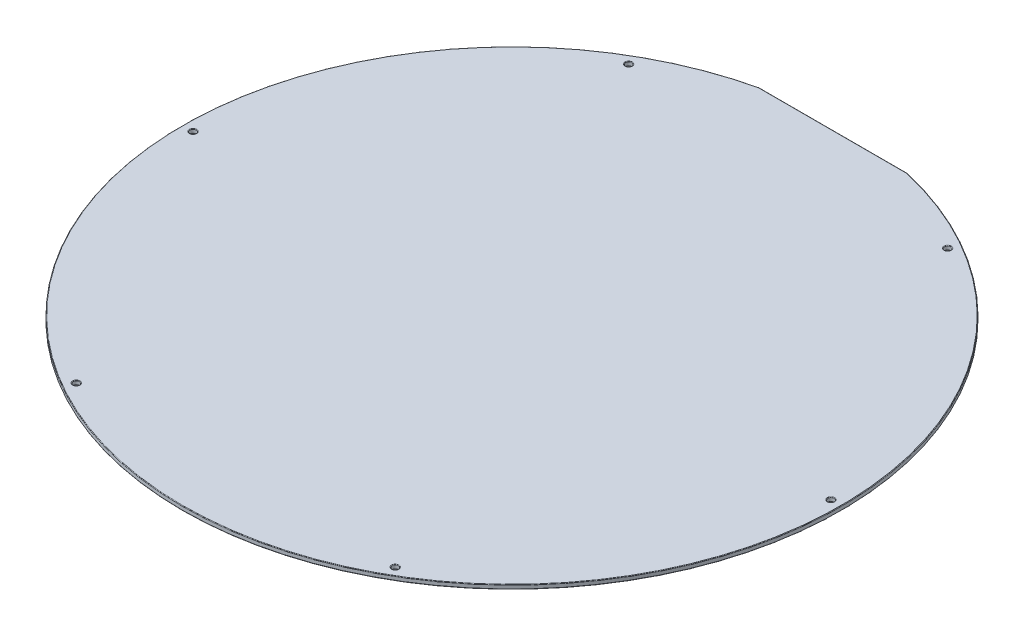
ISO-10303-21;
HEADER;
FILE_DESCRIPTION(('STEP AP214'),'2;1');
FILE_NAME('part.step','',(''),(''),'','','');
FILE_SCHEMA(('AUTOMOTIVE_DESIGN { 1 0 10303 214 1 1 1 1 }'));
ENDSEC;
DATA;
#1=APPLICATION_CONTEXT('core data for automotive mechanical design processes');
#2=APPLICATION_PROTOCOL_DEFINITION('international standard','automotive_design',2000,#1);
#3=PRODUCT_CONTEXT('',#1,'mechanical');
#4=PRODUCT('Part','Part','',(#3));
#5=PRODUCT_RELATED_PRODUCT_CATEGORY('part','',(#4));
#6=PRODUCT_DEFINITION_FORMATION('','',#4);
#7=PRODUCT_DEFINITION_CONTEXT('part definition',#1,'design');
#8=PRODUCT_DEFINITION('design','',#6,#7);
#9=PRODUCT_DEFINITION_SHAPE('','',#8);
#10=(LENGTH_UNIT() NAMED_UNIT(*) SI_UNIT(.MILLI.,.METRE.));
#11=(NAMED_UNIT(*) PLANE_ANGLE_UNIT() SI_UNIT($,.RADIAN.));
#12=(NAMED_UNIT(*) SI_UNIT($,.STERADIAN.) SOLID_ANGLE_UNIT());
#13=UNCERTAINTY_MEASURE_WITH_UNIT(LENGTH_MEASURE(1.E-05),#10,'distance_accuracy_value','');
#14=(GEOMETRIC_REPRESENTATION_CONTEXT(3) GLOBAL_UNCERTAINTY_ASSIGNED_CONTEXT((#13)) GLOBAL_UNIT_ASSIGNED_CONTEXT((#10,
#11,#12)) REPRESENTATION_CONTEXT('',''));
#15=CARTESIAN_POINT('',(0.,0.,0.));
#16=DIRECTION('',(0.,0.,1.));
#17=DIRECTION('',(1.,0.,0.));
#18=AXIS2_PLACEMENT_3D('',#15,#16,#17);
#19=CARTESIAN_POINT('',(0.,2.,0.));
#20=DIRECTION('',(0.,1.,0.));
#21=DIRECTION('',(0.,0.,1.));
#22=AXIS2_PLACEMENT_3D('',#19,#20,#21);
#23=PLANE('',#22);
#24=CARTESIAN_POINT('',(-75.,2.,-129.903810567666));
#25=DIRECTION('',(0.,1.,0.));
#26=DIRECTION('',(0.,0.,1.));
#27=AXIS2_PLACEMENT_3D('',#24,#25,#26);
#28=CIRCLE('',#27,1.75);
#29=CARTESIAN_POINT('',(-75.,2.,-128.153810567666));
#30=VERTEX_POINT('',#29);
#31=EDGE_CURVE('E11',#30,#30,#28,.F.);
#32=ORIENTED_EDGE('',*,*,#31,.T.);
#33=EDGE_LOOP('',(#32));
#34=FACE_BOUND('',#33,.T.);
#35=CARTESIAN_POINT('',(-75.,2.,129.903810567666));
#36=DIRECTION('',(0.,1.,0.));
#37=DIRECTION('',(0.,0.,1.));
#38=AXIS2_PLACEMENT_3D('',#35,#36,#37);
#39=CIRCLE('',#38,1.75);
#40=CARTESIAN_POINT('',(-75.,2.,131.653810567666));
#41=VERTEX_POINT('',#40);
#42=EDGE_CURVE('E47',#41,#41,#39,.F.);
#43=ORIENTED_EDGE('',*,*,#42,.T.);
#44=EDGE_LOOP('',(#43));
#45=FACE_BOUND('',#44,.T.);
#46=CARTESIAN_POINT('',(150.,2.,0.));
#47=DIRECTION('',(0.,1.,0.));
#48=DIRECTION('',(0.,0.,1.));
#49=AXIS2_PLACEMENT_3D('',#46,#47,#48);
#50=CIRCLE('',#49,1.75);
#51=CARTESIAN_POINT('',(150.,2.,1.75));
#52=VERTEX_POINT('',#51);
#53=EDGE_CURVE('E172',#52,#52,#50,.F.);
#54=ORIENTED_EDGE('',*,*,#53,.T.);
#55=EDGE_LOOP('',(#54));
#56=FACE_BOUND('',#55,.T.);
#57=CARTESIAN_POINT('',(0.,2.,0.));
#58=DIRECTION('',(0.,1.,0.));
#59=DIRECTION('',(0.,0.,1.));
#60=AXIS2_PLACEMENT_3D('',#57,#58,#59);
#61=CIRCLE('',#60,154.75);
#62=CARTESIAN_POINT('',(-34.9713932286477,2.,-150.746688705415));
#63=VERTEX_POINT('',#62);
#64=CARTESIAN_POINT('',(34.9713932286477,2.,-150.746688705415));
#65=VERTEX_POINT('',#64);
#66=EDGE_CURVE('E54',#63,#65,#61,.T.);
#67=ORIENTED_EDGE('',*,*,#66,.T.);
#68=DIRECTION('',(-1.,0.,0.));
#69=VECTOR('',#68,1.);
#70=CARTESIAN_POINT('',(-35.,2.,-150.746688705415));
#71=LINE('',#70,#69);
#72=EDGE_CURVE('E170',#65,#63,#71,.T.);
#73=ORIENTED_EDGE('',*,*,#72,.T.);
#74=EDGE_LOOP('',(#67,#73));
#75=FACE_BOUND('',#74,.T.);
#76=CARTESIAN_POINT('',(75.,2.,-129.903810567666));
#77=DIRECTION('',(0.,1.,0.));
#78=DIRECTION('',(0.,0.,1.));
#79=AXIS2_PLACEMENT_3D('',#76,#77,#78);
#80=CIRCLE('',#79,1.75);
#81=CARTESIAN_POINT('',(75.,2.,-128.153810567666));
#82=VERTEX_POINT('',#81);
#83=EDGE_CURVE('E166',#82,#82,#80,.F.);
#84=ORIENTED_EDGE('',*,*,#83,.T.);
#85=EDGE_LOOP('',(#84));
#86=FACE_BOUND('',#85,.T.);
#87=CARTESIAN_POINT('',(75.,2.,129.903810567666));
#88=DIRECTION('',(0.,1.,0.));
#89=DIRECTION('',(0.,0.,1.));
#90=AXIS2_PLACEMENT_3D('',#87,#88,#89);
#91=CIRCLE('',#90,1.75);
#92=CARTESIAN_POINT('',(75.,2.,131.653810567666));
#93=VERTEX_POINT('',#92);
#94=EDGE_CURVE('E163',#93,#93,#91,.F.);
#95=ORIENTED_EDGE('',*,*,#94,.T.);
#96=EDGE_LOOP('',(#95));
#97=FACE_BOUND('',#96,.T.);
#98=CARTESIAN_POINT('',(-150.,2.,0.));
#99=DIRECTION('',(0.,1.,0.));
#100=DIRECTION('',(0.,0.,1.));
#101=AXIS2_PLACEMENT_3D('',#98,#99,#100);
#102=CIRCLE('',#101,1.75);
#103=CARTESIAN_POINT('',(-150.,2.,1.75));
#104=VERTEX_POINT('',#103);
#105=EDGE_CURVE('E160',#104,#104,#102,.F.);
#106=ORIENTED_EDGE('',*,*,#105,.T.);
#107=EDGE_LOOP('',(#106));
#108=FACE_BOUND('',#107,.T.);
#109=ADVANCED_FACE('F33',(#34,#45,#56,#75,#86,#97,#108),#23,.T.);
#110=CARTESIAN_POINT('',(0.,0.,0.));
#111=DIRECTION('',(0.,1.,0.));
#112=DIRECTION('',(0.,0.,1.));
#113=AXIS2_PLACEMENT_3D('',#110,#111,#112);
#114=PLANE('',#113);
#115=CARTESIAN_POINT('',(-75.,0.,-129.903810567666));
#116=DIRECTION('',(0.,1.,0.));
#117=DIRECTION('',(0.,0.,1.));
#118=AXIS2_PLACEMENT_3D('',#115,#116,#117);
#119=CIRCLE('',#118,1.75);
#120=CARTESIAN_POINT('',(-75.,0.,-128.153810567666));
#121=VERTEX_POINT('',#120);
#122=EDGE_CURVE('E113',#121,#121,#119,.T.);
#123=ORIENTED_EDGE('',*,*,#122,.T.);
#124=EDGE_LOOP('',(#123));
#125=FACE_BOUND('',#124,.T.);
#126=CARTESIAN_POINT('',(-75.,0.,129.903810567666));
#127=DIRECTION('',(0.,1.,0.));
#128=DIRECTION('',(0.,0.,1.));
#129=AXIS2_PLACEMENT_3D('',#126,#127,#128);
#130=CIRCLE('',#129,1.75);
#131=CARTESIAN_POINT('',(-75.,0.,131.653810567666));
#132=VERTEX_POINT('',#131);
#133=EDGE_CURVE('E107',#132,#132,#130,.T.);
#134=ORIENTED_EDGE('',*,*,#133,.T.);
#135=EDGE_LOOP('',(#134));
#136=FACE_BOUND('',#135,.T.);
#137=CARTESIAN_POINT('',(150.,0.,0.));
#138=DIRECTION('',(0.,1.,0.));
#139=DIRECTION('',(0.,0.,1.));
#140=AXIS2_PLACEMENT_3D('',#137,#138,#139);
#141=CIRCLE('',#140,1.75);
#142=CARTESIAN_POINT('',(150.,0.,1.75));
#143=VERTEX_POINT('',#142);
#144=EDGE_CURVE('E104',#143,#143,#141,.T.);
#145=ORIENTED_EDGE('',*,*,#144,.T.);
#146=EDGE_LOOP('',(#145));
#147=FACE_BOUND('',#146,.T.);
#148=CARTESIAN_POINT('',(0.,0.,0.));
#149=DIRECTION('',(0.,1.,0.));
#150=DIRECTION('',(0.,0.,1.));
#151=AXIS2_PLACEMENT_3D('',#148,#149,#150);
#152=CIRCLE('',#151,154.75);
#153=CARTESIAN_POINT('',(34.9713932286477,0.,-150.746688705415));
#154=VERTEX_POINT('',#153);
#155=CARTESIAN_POINT('',(-34.9713932286477,0.,-150.746688705415));
#156=VERTEX_POINT('',#155);
#157=EDGE_CURVE('E97',#154,#156,#152,.F.);
#158=ORIENTED_EDGE('',*,*,#157,.T.);
#159=DIRECTION('',(-1.,0.,0.));
#160=VECTOR('',#159,1.);
#161=CARTESIAN_POINT('',(0.,0.,-150.746688705415));
#162=LINE('',#161,#160);
#163=EDGE_CURVE('E88',#156,#154,#162,.F.);
#164=ORIENTED_EDGE('',*,*,#163,.T.);
#165=EDGE_LOOP('',(#158,#164));
#166=FACE_BOUND('',#165,.T.);
#167=CARTESIAN_POINT('',(75.,0.,-129.903810567666));
#168=DIRECTION('',(0.,1.,0.));
#169=DIRECTION('',(0.,0.,1.));
#170=AXIS2_PLACEMENT_3D('',#167,#168,#169);
#171=CIRCLE('',#170,1.75);
#172=CARTESIAN_POINT('',(75.,0.,-128.153810567666));
#173=VERTEX_POINT('',#172);
#174=EDGE_CURVE('E100',#173,#173,#171,.T.);
#175=ORIENTED_EDGE('',*,*,#174,.T.);
#176=EDGE_LOOP('',(#175));
#177=FACE_BOUND('',#176,.T.);
#178=CARTESIAN_POINT('',(75.,0.,129.903810567666));
#179=DIRECTION('',(0.,1.,0.));
#180=DIRECTION('',(0.,0.,1.));
#181=AXIS2_PLACEMENT_3D('',#178,#179,#180);
#182=CIRCLE('',#181,1.75);
#183=CARTESIAN_POINT('',(75.,0.,131.653810567666));
#184=VERTEX_POINT('',#183);
#185=EDGE_CURVE('E239',#184,#184,#182,.T.);
#186=ORIENTED_EDGE('',*,*,#185,.T.);
#187=EDGE_LOOP('',(#186));
#188=FACE_BOUND('',#187,.T.);
#189=CARTESIAN_POINT('',(-150.,0.,0.));
#190=DIRECTION('',(0.,1.,0.));
#191=DIRECTION('',(0.,0.,1.));
#192=AXIS2_PLACEMENT_3D('',#189,#190,#191);
#193=CIRCLE('',#192,1.75);
#194=CARTESIAN_POINT('',(-150.,0.,1.75));
#195=VERTEX_POINT('',#194);
#196=EDGE_CURVE('E236',#195,#195,#193,.T.);
#197=ORIENTED_EDGE('',*,*,#196,.T.);
#198=EDGE_LOOP('',(#197));
#199=FACE_BOUND('',#198,.T.);
#200=ADVANCED_FACE('F102',(#125,#136,#147,#166,#177,#188,#199),#114,.F.);
#201=CARTESIAN_POINT('',(0.,2.,0.));
#202=DIRECTION('',(0.,-1.,0.));
#203=DIRECTION('',(0.,0.,-1.));
#204=AXIS2_PLACEMENT_3D('',#201,#202,#203);
#205=CYLINDRICAL_SURFACE('',#204,155.);
#206=DIRECTION('',(0.,-1.,0.));
#207=VECTOR('',#206,1.);
#208=CARTESIAN_POINT('',(-35.,2.,-150.996688705415));
#209=LINE('',#208,#207);
#210=CARTESIAN_POINT('',(-35.,1.75,-150.996688705415));
#211=VERTEX_POINT('',#210);
#212=CARTESIAN_POINT('',(-35.,0.25,-150.996688705415));
#213=VERTEX_POINT('',#212);
#214=EDGE_CURVE('E94',#211,#213,#209,.T.);
#215=ORIENTED_EDGE('',*,*,#214,.T.);
#216=CARTESIAN_POINT('',(0.,0.25,0.));
#217=DIRECTION('',(0.,1.,0.));
#218=DIRECTION('',(0.,0.,1.));
#219=AXIS2_PLACEMENT_3D('',#216,#217,#218);
#220=CIRCLE('',#219,155.);
#221=CARTESIAN_POINT('',(35.,0.25,-150.996688705415));
#222=VERTEX_POINT('',#221);
#223=EDGE_CURVE('E140',#213,#222,#220,.T.);
#224=ORIENTED_EDGE('',*,*,#223,.T.);
#225=DIRECTION('',(0.,-1.,0.));
#226=VECTOR('',#225,1.);
#227=CARTESIAN_POINT('',(35.,2.,-150.996688705415));
#228=LINE('',#227,#226);
#229=CARTESIAN_POINT('',(35.,1.75,-150.996688705415));
#230=VERTEX_POINT('',#229);
#231=EDGE_CURVE('E234',#230,#222,#228,.T.);
#232=ORIENTED_EDGE('',*,*,#231,.F.);
#233=CARTESIAN_POINT('',(0.,1.75,0.));
#234=DIRECTION('',(0.,1.,0.));
#235=DIRECTION('',(0.,0.,1.));
#236=AXIS2_PLACEMENT_3D('',#233,#234,#235);
#237=CIRCLE('',#236,155.);
#238=EDGE_CURVE('E138',#230,#211,#237,.F.);
#239=ORIENTED_EDGE('',*,*,#238,.T.);
#240=EDGE_LOOP('',(#215,#224,#232,#239));
#241=FACE_BOUND('',#240,.T.);
#242=ADVANCED_FACE('F235',(#241),#205,.T.);
#243=CARTESIAN_POINT('',(-35.,2.,-150.996688705415));
#244=DIRECTION('',(0.,0.,1.));
#245=DIRECTION('',(1.,0.,0.));
#246=AXIS2_PLACEMENT_3D('',#243,#244,#245);
#247=PLANE('',#246);
#248=ORIENTED_EDGE('',*,*,#231,.T.);
#249=DIRECTION('',(-1.,0.,0.));
#250=VECTOR('',#249,1.);
#251=CARTESIAN_POINT('',(-35.,0.25,-150.996688705415));
#252=LINE('',#251,#250);
#253=EDGE_CURVE('E91',#222,#213,#252,.T.);
#254=ORIENTED_EDGE('',*,*,#253,.T.);
#255=ORIENTED_EDGE('',*,*,#214,.F.);
#256=DIRECTION('',(-1.,0.,0.));
#257=VECTOR('',#256,1.);
#258=CARTESIAN_POINT('',(35.,1.75,-150.996688705415));
#259=LINE('',#258,#257);
#260=EDGE_CURVE('E134',#211,#230,#259,.F.);
#261=ORIENTED_EDGE('',*,*,#260,.T.);
#262=EDGE_LOOP('',(#248,#254,#255,#261));
#263=FACE_BOUND('',#262,.T.);
#264=ADVANCED_FACE('F233',(#263),#247,.F.);
#265=CARTESIAN_POINT('',(75.,2.,-129.903810567666));
#266=DIRECTION('',(0.,-1.,0.));
#267=DIRECTION('',(0.,0.,-1.));
#268=AXIS2_PLACEMENT_3D('',#265,#266,#267);
#269=CYLINDRICAL_SURFACE('',#268,1.5);
#270=CARTESIAN_POINT('',(75.,0.25,-129.903810567666));
#271=DIRECTION('',(0.,1.,0.));
#272=DIRECTION('',(0.,0.,1.));
#273=AXIS2_PLACEMENT_3D('',#270,#271,#272);
#274=CIRCLE('',#273,1.5);
#275=CARTESIAN_POINT('',(75.,0.25,-128.403810567666));
#276=VERTEX_POINT('',#275);
#277=EDGE_CURVE('E145',#276,#276,#274,.F.);
#278=ORIENTED_EDGE('',*,*,#277,.T.);
#279=EDGE_LOOP('',(#278));
#280=FACE_BOUND('',#279,.T.);
#281=CARTESIAN_POINT('',(75.,1.75,-129.903810567666));
#282=DIRECTION('',(0.,1.,0.));
#283=DIRECTION('',(0.,0.,1.));
#284=AXIS2_PLACEMENT_3D('',#281,#282,#283);
#285=CIRCLE('',#284,1.5);
#286=CARTESIAN_POINT('',(75.,1.75,-128.403810567666));
#287=VERTEX_POINT('',#286);
#288=EDGE_CURVE('E142',#287,#287,#285,.T.);
#289=ORIENTED_EDGE('',*,*,#288,.T.);
#290=EDGE_LOOP('',(#289));
#291=FACE_BOUND('',#290,.T.);
#292=ADVANCED_FACE('F267',(#280,#291),#269,.F.);
#293=CARTESIAN_POINT('',(150.,2.,0.));
#294=DIRECTION('',(0.,-1.,0.));
#295=DIRECTION('',(0.,0.,-1.));
#296=AXIS2_PLACEMENT_3D('',#293,#294,#295);
#297=CYLINDRICAL_SURFACE('',#296,1.5);
#298=CARTESIAN_POINT('',(150.,0.25,0.));
#299=DIRECTION('',(0.,1.,0.));
#300=DIRECTION('',(0.,0.,1.));
#301=AXIS2_PLACEMENT_3D('',#298,#299,#300);
#302=CIRCLE('',#301,1.5);
#303=CARTESIAN_POINT('',(150.,0.25,1.5));
#304=VERTEX_POINT('',#303);
#305=EDGE_CURVE('E131',#304,#304,#302,.F.);
#306=ORIENTED_EDGE('',*,*,#305,.T.);
#307=EDGE_LOOP('',(#306));
#308=FACE_BOUND('',#307,.T.);
#309=CARTESIAN_POINT('',(150.,1.75,0.));
#310=DIRECTION('',(0.,1.,0.));
#311=DIRECTION('',(0.,0.,1.));
#312=AXIS2_PLACEMENT_3D('',#309,#310,#311);
#313=CIRCLE('',#312,1.5);
#314=CARTESIAN_POINT('',(150.,1.75,1.5));
#315=VERTEX_POINT('',#314);
#316=EDGE_CURVE('E128',#315,#315,#313,.T.);
#317=ORIENTED_EDGE('',*,*,#316,.T.);
#318=EDGE_LOOP('',(#317));
#319=FACE_BOUND('',#318,.T.);
#320=ADVANCED_FACE('F288',(#308,#319),#297,.F.);
#321=CARTESIAN_POINT('',(75.,2.,129.903810567666));
#322=DIRECTION('',(0.,-1.,0.));
#323=DIRECTION('',(0.,0.,-1.));
#324=AXIS2_PLACEMENT_3D('',#321,#322,#323);
#325=CYLINDRICAL_SURFACE('',#324,1.5);
#326=CARTESIAN_POINT('',(75.,0.25,129.903810567666));
#327=DIRECTION('',(0.,1.,0.));
#328=DIRECTION('',(0.,0.,1.));
#329=AXIS2_PLACEMENT_3D('',#326,#327,#328);
#330=CIRCLE('',#329,1.5);
#331=CARTESIAN_POINT('',(75.,0.25,131.403810567666));
#332=VERTEX_POINT('',#331);
#333=EDGE_CURVE('E151',#332,#332,#330,.F.);
#334=ORIENTED_EDGE('',*,*,#333,.T.);
#335=EDGE_LOOP('',(#334));
#336=FACE_BOUND('',#335,.T.);
#337=CARTESIAN_POINT('',(75.,1.75,129.903810567666));
#338=DIRECTION('',(0.,1.,0.));
#339=DIRECTION('',(0.,0.,1.));
#340=AXIS2_PLACEMENT_3D('',#337,#338,#339);
#341=CIRCLE('',#340,1.5);
#342=CARTESIAN_POINT('',(75.,1.75,131.403810567666));
#343=VERTEX_POINT('',#342);
#344=EDGE_CURVE('E148',#343,#343,#341,.T.);
#345=ORIENTED_EDGE('',*,*,#344,.T.);
#346=EDGE_LOOP('',(#345));
#347=FACE_BOUND('',#346,.T.);
#348=ADVANCED_FACE('F291',(#336,#347),#325,.F.);
#349=CARTESIAN_POINT('',(-75.,2.,129.903810567666));
#350=DIRECTION('',(0.,-1.,0.));
#351=DIRECTION('',(0.,0.,-1.));
#352=AXIS2_PLACEMENT_3D('',#349,#350,#351);
#353=CYLINDRICAL_SURFACE('',#352,1.5);
#354=CARTESIAN_POINT('',(-75.,0.25,129.903810567666));
#355=DIRECTION('',(0.,1.,0.));
#356=DIRECTION('',(0.,0.,1.));
#357=AXIS2_PLACEMENT_3D('',#354,#355,#356);
#358=CIRCLE('',#357,1.5);
#359=CARTESIAN_POINT('',(-75.,0.25,131.403810567666));
#360=VERTEX_POINT('',#359);
#361=EDGE_CURVE('E125',#360,#360,#358,.F.);
#362=ORIENTED_EDGE('',*,*,#361,.T.);
#363=EDGE_LOOP('',(#362));
#364=FACE_BOUND('',#363,.T.);
#365=CARTESIAN_POINT('',(-75.,1.75,129.903810567666));
#366=DIRECTION('',(0.,1.,0.));
#367=DIRECTION('',(0.,0.,1.));
#368=AXIS2_PLACEMENT_3D('',#365,#366,#367);
#369=CIRCLE('',#368,1.5);
#370=CARTESIAN_POINT('',(-75.,1.75,131.403810567666));
#371=VERTEX_POINT('',#370);
#372=EDGE_CURVE('E122',#371,#371,#369,.T.);
#373=ORIENTED_EDGE('',*,*,#372,.T.);
#374=EDGE_LOOP('',(#373));
#375=FACE_BOUND('',#374,.T.);
#376=ADVANCED_FACE('F299',(#364,#375),#353,.F.);
#377=CARTESIAN_POINT('',(-150.,2.,0.));
#378=DIRECTION('',(0.,-1.,0.));
#379=DIRECTION('',(0.,0.,-1.));
#380=AXIS2_PLACEMENT_3D('',#377,#378,#379);
#381=CYLINDRICAL_SURFACE('',#380,1.5);
#382=CARTESIAN_POINT('',(-150.,0.25,0.));
#383=DIRECTION('',(0.,1.,0.));
#384=DIRECTION('',(0.,0.,1.));
#385=AXIS2_PLACEMENT_3D('',#382,#383,#384);
#386=CIRCLE('',#385,1.5);
#387=CARTESIAN_POINT('',(-150.,0.25,1.5));
#388=VERTEX_POINT('',#387);
#389=EDGE_CURVE('E157',#388,#388,#386,.F.);
#390=ORIENTED_EDGE('',*,*,#389,.T.);
#391=EDGE_LOOP('',(#390));
#392=FACE_BOUND('',#391,.T.);
#393=CARTESIAN_POINT('',(-150.,1.75,0.));
#394=DIRECTION('',(0.,1.,0.));
#395=DIRECTION('',(0.,0.,1.));
#396=AXIS2_PLACEMENT_3D('',#393,#394,#395);
#397=CIRCLE('',#396,1.5);
#398=CARTESIAN_POINT('',(-150.,1.75,1.5));
#399=VERTEX_POINT('',#398);
#400=EDGE_CURVE('E154',#399,#399,#397,.T.);
#401=ORIENTED_EDGE('',*,*,#400,.T.);
#402=EDGE_LOOP('',(#401));
#403=FACE_BOUND('',#402,.T.);
#404=ADVANCED_FACE('F306',(#392,#403),#381,.F.);
#405=CARTESIAN_POINT('',(-75.,2.,-129.903810567666));
#406=DIRECTION('',(0.,-1.,0.));
#407=DIRECTION('',(0.,0.,-1.));
#408=AXIS2_PLACEMENT_3D('',#405,#406,#407);
#409=CYLINDRICAL_SURFACE('',#408,1.5);
#410=CARTESIAN_POINT('',(-75.,0.25,-129.903810567666));
#411=DIRECTION('',(0.,1.,0.));
#412=DIRECTION('',(0.,0.,1.));
#413=AXIS2_PLACEMENT_3D('',#410,#411,#412);
#414=CIRCLE('',#413,1.5);
#415=CARTESIAN_POINT('',(-75.,0.25,-128.403810567666));
#416=VERTEX_POINT('',#415);
#417=EDGE_CURVE('E119',#416,#416,#414,.F.);
#418=ORIENTED_EDGE('',*,*,#417,.T.);
#419=EDGE_LOOP('',(#418));
#420=FACE_BOUND('',#419,.T.);
#421=CARTESIAN_POINT('',(-75.,1.75,-129.903810567666));
#422=DIRECTION('',(0.,1.,0.));
#423=DIRECTION('',(0.,0.,1.));
#424=AXIS2_PLACEMENT_3D('',#421,#422,#423);
#425=CIRCLE('',#424,1.5);
#426=CARTESIAN_POINT('',(-75.,1.75,-128.403810567666));
#427=VERTEX_POINT('',#426);
#428=EDGE_CURVE('E116',#427,#427,#425,.T.);
#429=ORIENTED_EDGE('',*,*,#428,.T.);
#430=EDGE_LOOP('',(#429));
#431=FACE_BOUND('',#430,.T.);
#432=ADVANCED_FACE('F273',(#420,#431),#409,.F.);
#433=CARTESIAN_POINT('',(-75.,0.25,-129.903810567666));
#434=DIRECTION('',(0.,1.,0.));
#435=DIRECTION('',(0.,0.,1.));
#436=AXIS2_PLACEMENT_3D('',#433,#434,#435);
#437=TOROIDAL_SURFACE('',#436,1.75,0.25);
#438=ORIENTED_EDGE('',*,*,#417,.F.);
#439=EDGE_LOOP('',(#438));
#440=FACE_BOUND('',#439,.T.);
#441=ORIENTED_EDGE('',*,*,#122,.F.);
#442=EDGE_LOOP('',(#441));
#443=FACE_BOUND('',#442,.T.);
#444=ADVANCED_FACE('F269',(#440,#443),#437,.T.);
#445=CARTESIAN_POINT('',(-75.,0.25,129.903810567666));
#446=DIRECTION('',(0.,1.,0.));
#447=DIRECTION('',(0.,0.,1.));
#448=AXIS2_PLACEMENT_3D('',#445,#446,#447);
#449=TOROIDAL_SURFACE('',#448,1.75,0.25);
#450=ORIENTED_EDGE('',*,*,#361,.F.);
#451=EDGE_LOOP('',(#450));
#452=FACE_BOUND('',#451,.T.);
#453=ORIENTED_EDGE('',*,*,#133,.F.);
#454=EDGE_LOOP('',(#453));
#455=FACE_BOUND('',#454,.T.);
#456=ADVANCED_FACE('F272',(#452,#455),#449,.T.);
#457=CARTESIAN_POINT('',(150.,0.25,0.));
#458=DIRECTION('',(0.,1.,0.));
#459=DIRECTION('',(0.,0.,1.));
#460=AXIS2_PLACEMENT_3D('',#457,#458,#459);
#461=TOROIDAL_SURFACE('',#460,1.75,0.25);
#462=ORIENTED_EDGE('',*,*,#305,.F.);
#463=EDGE_LOOP('',(#462));
#464=FACE_BOUND('',#463,.T.);
#465=ORIENTED_EDGE('',*,*,#144,.F.);
#466=EDGE_LOOP('',(#465));
#467=FACE_BOUND('',#466,.T.);
#468=ADVANCED_FACE('F276',(#464,#467),#461,.T.);
#469=CARTESIAN_POINT('',(0.,0.25,0.));
#470=DIRECTION('',(0.,1.,0.));
#471=DIRECTION('',(0.,0.,1.));
#472=AXIS2_PLACEMENT_3D('',#469,#470,#471);
#473=TOROIDAL_SURFACE('',#472,154.75,0.25);
#474=CARTESIAN_POINT('',(-35.,0.25,-150.996688705415));
#475=CARTESIAN_POINT('',(-35.0000013977358,0.236001902381036,-150.996700952492));
#476=CARTESIAN_POINT('',(-34.9998656109337,0.22200791211606,-150.995513774136));
#477=CARTESIAN_POINT('',(-34.9993300361317,0.194429074142972,-150.990831410379));
#478=CARTESIAN_POINT('',(-34.9989304857976,0.18084386960738,-150.987338302752));
#479=CARTESIAN_POINT('',(-34.9978774989939,0.154451460670398,-150.978132713389));
#480=CARTESIAN_POINT('',(-34.9972239571134,0.141644581842372,-150.972419310194));
#481=CARTESIAN_POINT('',(-34.9956826437945,0.117176689622095,-150.958945338978));
#482=CARTESIAN_POINT('',(-34.9947949170173,0.105515458325406,-150.951185161295));
#483=CARTESIAN_POINT('',(-34.992807888313,0.0836296763848777,-150.933816118152));
#484=CARTESIAN_POINT('',(-34.9917080024005,0.0734092292200434,-150.924202150007));
#485=CARTESIAN_POINT('',(-34.9893293073268,0.0547222575348269,-150.903411418143));
#486=CARTESIAN_POINT('',(-34.9880504312649,0.0462563917696552,-150.892234070083));
#487=CARTESIAN_POINT('',(-34.9853417550597,0.0312659158502349,-150.868561756103));
#488=CARTESIAN_POINT('',(-34.9839110359185,0.0247541598121267,-150.856058767533));
#489=CARTESIAN_POINT('',(-34.9809465846174,0.0139277125015196,-150.830154287579));
#490=CARTESIAN_POINT('',(-34.979412949107,0.00961099165677891,-150.816753639215));
#491=CARTESIAN_POINT('',(-34.9769147145394,0.00455379360237378,-150.794925987564));
#492=CARTESIAN_POINT('',(-34.975968648119,0.00307335749850379,-150.786660317372));
#493=CARTESIAN_POINT('',(-34.9740652442062,0.000951516199452288,-150.770031188466));
#494=CARTESIAN_POINT('',(-34.9731079246245,0.000308922672447563,-150.761667885262));
#495=CARTESIAN_POINT('',(-34.9718976151549,2.90659898144835E-05,-150.751094856337));
#496=CARTESIAN_POINT('',(-34.9716454010019,-7.89054249028623E-08,-150.748891586271));
#497=CARTESIAN_POINT('',(-34.9713932286477,0.,-150.746688705415));
#498=B_SPLINE_CURVE_WITH_KNOTS('',3,(#474,#475,#476,#477,#478,#479,#480,#481,#482,#483,#484,
#485,#486,#487,#488,#489,#490,#491,#492,#493,#494,#495,#496,#497),.UNSPECIFIED.,.F.,.F.,(4,2,2,
2,2,2,2,2,2,2,2,4),(0.,0.0419373976831481,0.0838370588833597,0.125754127744786,
0.167663208398066,0.209689337274838,0.251731216334823,0.294043872164397,0.336317333423737,
0.361632351147503,0.38691142478818,0.393564099963632),.UNSPECIFIED.);
#499=EDGE_CURVE('E95',#156,#213,#498,.F.);
#500=ORIENTED_EDGE('',*,*,#499,.F.);
#501=ORIENTED_EDGE('',*,*,#157,.F.);
#502=CARTESIAN_POINT('',(35.,0.25,-150.996688705415));
#503=CARTESIAN_POINT('',(35.0000013977358,0.236001902381036,-150.996700952492));
#504=CARTESIAN_POINT('',(34.9998656109337,0.22200791211606,-150.995513774136));
#505=CARTESIAN_POINT('',(34.9993300361317,0.194429074142972,-150.990831410379));
#506=CARTESIAN_POINT('',(34.9989304857976,0.18084386960738,-150.987338302752));
#507=CARTESIAN_POINT('',(34.9978774989939,0.154451460670398,-150.978132713389));
#508=CARTESIAN_POINT('',(34.9972239571134,0.141644581842372,-150.972419310194));
#509=CARTESIAN_POINT('',(34.9956826437945,0.117176689622095,-150.958945338978));
#510=CARTESIAN_POINT('',(34.9947949170173,0.105515458325406,-150.951185161295));
#511=CARTESIAN_POINT('',(34.992807888313,0.0836296763848777,-150.933816118152));
#512=CARTESIAN_POINT('',(34.9917080024005,0.0734092292200434,-150.924202150007));
#513=CARTESIAN_POINT('',(34.9893293073268,0.0547222575348269,-150.903411418143));
#514=CARTESIAN_POINT('',(34.9880504312649,0.0462563917696552,-150.892234070083));
#515=CARTESIAN_POINT('',(34.9853417550597,0.0312659158502349,-150.868561756103));
#516=CARTESIAN_POINT('',(34.9839110359185,0.0247541598121267,-150.856058767533));
#517=CARTESIAN_POINT('',(34.9809465846174,0.0139277125015196,-150.830154287579));
#518=CARTESIAN_POINT('',(34.979412949107,0.00961099165677891,-150.816753639215));
#519=CARTESIAN_POINT('',(34.9769147145394,0.00455379360237378,-150.794925987564));
#520=CARTESIAN_POINT('',(34.975968648119,0.00307335749850379,-150.786660317372));
#521=CARTESIAN_POINT('',(34.9740652442062,0.000951516199452288,-150.770031188466));
#522=CARTESIAN_POINT('',(34.9731079246245,0.000308922672447563,-150.761667885262));
#523=CARTESIAN_POINT('',(34.9718976151549,2.90659898144835E-05,-150.751094856337));
#524=CARTESIAN_POINT('',(34.9716454010019,-7.89054249028623E-08,-150.748891586271));
#525=CARTESIAN_POINT('',(34.9713932286477,0.,-150.746688705415));
#526=B_SPLINE_CURVE_WITH_KNOTS('',3,(#502,#503,#504,#505,#506,#507,#508,#509,#510,#511,#512,
#513,#514,#515,#516,#517,#518,#519,#520,#521,#522,#523,#524,#525),.UNSPECIFIED.,.F.,.F.,(4,2,2,
2,2,2,2,2,2,2,2,4),(0.,0.0419373976831481,0.0838370588833597,0.125754127744786,
0.167663208398066,0.209689337274838,0.251731216334823,0.294043872164397,0.336317333423737,
0.361632351147503,0.38691142478818,0.393564099963632),.UNSPECIFIED.);
#527=EDGE_CURVE('E84',#222,#154,#526,.T.);
#528=ORIENTED_EDGE('',*,*,#527,.F.);
#529=ORIENTED_EDGE('',*,*,#223,.F.);
#530=EDGE_LOOP('',(#500,#501,#528,#529));
#531=FACE_BOUND('',#530,.T.);
#532=ADVANCED_FACE('F98',(#531),#473,.T.);
#533=CARTESIAN_POINT('',(-35.,0.25,-150.746688705415));
#534=DIRECTION('',(-1.,0.,0.));
#535=DIRECTION('',(0.,0.,1.));
#536=AXIS2_PLACEMENT_3D('',#533,#534,#535);
#537=CYLINDRICAL_SURFACE('',#536,0.25);
#538=ORIENTED_EDGE('',*,*,#527,.T.);
#539=ORIENTED_EDGE('',*,*,#163,.F.);
#540=ORIENTED_EDGE('',*,*,#499,.T.);
#541=ORIENTED_EDGE('',*,*,#253,.F.);
#542=EDGE_LOOP('',(#538,#539,#540,#541));
#543=FACE_BOUND('',#542,.T.);
#544=ADVANCED_FACE('F86',(#543),#537,.T.);
#545=CARTESIAN_POINT('',(75.,0.25,-129.903810567666));
#546=DIRECTION('',(0.,1.,0.));
#547=DIRECTION('',(0.,0.,1.));
#548=AXIS2_PLACEMENT_3D('',#545,#546,#547);
#549=TOROIDAL_SURFACE('',#548,1.75,0.25);
#550=ORIENTED_EDGE('',*,*,#277,.F.);
#551=EDGE_LOOP('',(#550));
#552=FACE_BOUND('',#551,.T.);
#553=ORIENTED_EDGE('',*,*,#174,.F.);
#554=EDGE_LOOP('',(#553));
#555=FACE_BOUND('',#554,.T.);
#556=ADVANCED_FACE('F190',(#552,#555),#549,.T.);
#557=CARTESIAN_POINT('',(75.,0.25,129.903810567666));
#558=DIRECTION('',(0.,1.,0.));
#559=DIRECTION('',(0.,0.,1.));
#560=AXIS2_PLACEMENT_3D('',#557,#558,#559);
#561=TOROIDAL_SURFACE('',#560,1.75,0.25);
#562=ORIENTED_EDGE('',*,*,#333,.F.);
#563=EDGE_LOOP('',(#562));
#564=FACE_BOUND('',#563,.T.);
#565=ORIENTED_EDGE('',*,*,#185,.F.);
#566=EDGE_LOOP('',(#565));
#567=FACE_BOUND('',#566,.T.);
#568=ADVANCED_FACE('F194',(#564,#567),#561,.T.);
#569=CARTESIAN_POINT('',(-150.,0.25,0.));
#570=DIRECTION('',(0.,1.,0.));
#571=DIRECTION('',(0.,0.,1.));
#572=AXIS2_PLACEMENT_3D('',#569,#570,#571);
#573=TOROIDAL_SURFACE('',#572,1.75,0.25);
#574=ORIENTED_EDGE('',*,*,#389,.F.);
#575=EDGE_LOOP('',(#574));
#576=FACE_BOUND('',#575,.T.);
#577=ORIENTED_EDGE('',*,*,#196,.F.);
#578=EDGE_LOOP('',(#577));
#579=FACE_BOUND('',#578,.T.);
#580=ADVANCED_FACE('F198',(#576,#579),#573,.T.);
#581=CARTESIAN_POINT('',(-75.,1.75,-129.903810567666));
#582=DIRECTION('',(0.,1.,0.));
#583=DIRECTION('',(0.,0.,1.));
#584=AXIS2_PLACEMENT_3D('',#581,#582,#583);
#585=TOROIDAL_SURFACE('',#584,1.75,0.25);
#586=ORIENTED_EDGE('',*,*,#31,.F.);
#587=EDGE_LOOP('',(#586));
#588=FACE_BOUND('',#587,.T.);
#589=ORIENTED_EDGE('',*,*,#428,.F.);
#590=EDGE_LOOP('',(#589));
#591=FACE_BOUND('',#590,.T.);
#592=ADVANCED_FACE('F202',(#588,#591),#585,.T.);
#593=CARTESIAN_POINT('',(-75.,1.75,129.903810567666));
#594=DIRECTION('',(0.,1.,0.));
#595=DIRECTION('',(0.,0.,1.));
#596=AXIS2_PLACEMENT_3D('',#593,#594,#595);
#597=TOROIDAL_SURFACE('',#596,1.75,0.25);
#598=ORIENTED_EDGE('',*,*,#42,.F.);
#599=EDGE_LOOP('',(#598));
#600=FACE_BOUND('',#599,.T.);
#601=ORIENTED_EDGE('',*,*,#372,.F.);
#602=EDGE_LOOP('',(#601));
#603=FACE_BOUND('',#602,.T.);
#604=ADVANCED_FACE('F206',(#600,#603),#597,.T.);
#605=CARTESIAN_POINT('',(150.,1.75,0.));
#606=DIRECTION('',(0.,1.,0.));
#607=DIRECTION('',(0.,0.,1.));
#608=AXIS2_PLACEMENT_3D('',#605,#606,#607);
#609=TOROIDAL_SURFACE('',#608,1.75,0.25);
#610=ORIENTED_EDGE('',*,*,#53,.F.);
#611=EDGE_LOOP('',(#610));
#612=FACE_BOUND('',#611,.T.);
#613=ORIENTED_EDGE('',*,*,#316,.F.);
#614=EDGE_LOOP('',(#613));
#615=FACE_BOUND('',#614,.T.);
#616=ADVANCED_FACE('F210',(#612,#615),#609,.T.);
#617=CARTESIAN_POINT('',(0.,1.75,0.));
#618=DIRECTION('',(0.,1.,0.));
#619=DIRECTION('',(0.,0.,1.));
#620=AXIS2_PLACEMENT_3D('',#617,#618,#619);
#621=TOROIDAL_SURFACE('',#620,154.75,0.25);
#622=CARTESIAN_POINT('',(-35.,1.75,-150.996688705415));
#623=CARTESIAN_POINT('',(-35.0000013977358,1.76399809761896,-150.996700952492));
#624=CARTESIAN_POINT('',(-34.9998656109337,1.77799208788394,-150.995513774136));
#625=CARTESIAN_POINT('',(-34.9993300361317,1.80557092585703,-150.990831410379));
#626=CARTESIAN_POINT('',(-34.9989304857976,1.81915613039262,-150.987338302752));
#627=CARTESIAN_POINT('',(-34.9978774989939,1.8455485393296,-150.978132713389));
#628=CARTESIAN_POINT('',(-34.9972239571134,1.85835541815763,-150.972419310194));
#629=CARTESIAN_POINT('',(-34.9956826437945,1.8828233103779,-150.958945338978));
#630=CARTESIAN_POINT('',(-34.9947949170173,1.89448454167459,-150.951185161295));
#631=CARTESIAN_POINT('',(-34.992807888313,1.91637032361512,-150.933816118152));
#632=CARTESIAN_POINT('',(-34.9917080024005,1.92659077077996,-150.924202150007));
#633=CARTESIAN_POINT('',(-34.9893293073268,1.94527774246517,-150.903411418143));
#634=CARTESIAN_POINT('',(-34.9880504312648,1.95374360823034,-150.892234070083));
#635=CARTESIAN_POINT('',(-34.9853417550597,1.96873408414976,-150.868561756103));
#636=CARTESIAN_POINT('',(-34.9839110359186,1.97524584018786,-150.856058767533));
#637=CARTESIAN_POINT('',(-34.9809465846175,1.98607228749848,-150.830154287579));
#638=CARTESIAN_POINT('',(-34.979412949107,1.99038900834322,-150.816753639215));
#639=CARTESIAN_POINT('',(-34.9769147145394,1.99544620639762,-150.794925987564));
#640=CARTESIAN_POINT('',(-34.9759686481191,1.9969266425015,-150.786660317372));
#641=CARTESIAN_POINT('',(-34.9740652442062,1.99904848380055,-150.770031188466));
#642=CARTESIAN_POINT('',(-34.9731079246245,1.99969107732755,-150.761667885262));
#643=CARTESIAN_POINT('',(-34.9718976151549,1.99997093401019,-150.751094856337));
#644=CARTESIAN_POINT('',(-34.9716454010019,2.00000007890542,-150.748891586271));
#645=CARTESIAN_POINT('',(-34.9713932286477,2.,-150.746688705415));
#646=B_SPLINE_CURVE_WITH_KNOTS('',3,(#622,#623,#624,#625,#626,#627,#628,#629,#630,#631,#632,
#633,#634,#635,#636,#637,#638,#639,#640,#641,#642,#643,#644,#645),.UNSPECIFIED.,.F.,.F.,(4,2,2,
2,2,2,2,2,2,2,2,4),(0.,0.0419373976831482,0.0838370588833598,0.125754127744786,
0.167663208398067,0.209689337274837,0.251731216334823,0.294043872164331,0.336317333423739,
0.361632351147503,0.386911424788181,0.393564099963634),.UNSPECIFIED.);
#647=EDGE_CURVE('E62',#211,#63,#646,.T.);
#648=ORIENTED_EDGE('',*,*,#647,.F.);
#649=ORIENTED_EDGE('',*,*,#238,.F.);
#650=CARTESIAN_POINT('',(35.,1.75,-150.996688705415));
#651=CARTESIAN_POINT('',(35.0000013977358,1.76399809761896,-150.996700952492));
#652=CARTESIAN_POINT('',(34.9998656109337,1.77799208788394,-150.995513774136));
#653=CARTESIAN_POINT('',(34.9993300361317,1.80557092585703,-150.990831410379));
#654=CARTESIAN_POINT('',(34.9989304857976,1.81915613039262,-150.987338302752));
#655=CARTESIAN_POINT('',(34.9978774989939,1.8455485393296,-150.978132713389));
#656=CARTESIAN_POINT('',(34.9972239571134,1.85835541815763,-150.972419310194));
#657=CARTESIAN_POINT('',(34.9956826437945,1.8828233103779,-150.958945338978));
#658=CARTESIAN_POINT('',(34.9947949170173,1.89448454167459,-150.951185161295));
#659=CARTESIAN_POINT('',(34.992807888313,1.91637032361512,-150.933816118152));
#660=CARTESIAN_POINT('',(34.9917080024005,1.92659077077996,-150.924202150007));
#661=CARTESIAN_POINT('',(34.9893293073268,1.94527774246517,-150.903411418143));
#662=CARTESIAN_POINT('',(34.9880504312648,1.95374360823034,-150.892234070083));
#663=CARTESIAN_POINT('',(34.9853417550597,1.96873408414976,-150.868561756103));
#664=CARTESIAN_POINT('',(34.9839110359186,1.97524584018786,-150.856058767533));
#665=CARTESIAN_POINT('',(34.9809465846175,1.98607228749848,-150.830154287579));
#666=CARTESIAN_POINT('',(34.979412949107,1.99038900834322,-150.816753639215));
#667=CARTESIAN_POINT('',(34.9769147145394,1.99544620639762,-150.794925987564));
#668=CARTESIAN_POINT('',(34.9759686481191,1.9969266425015,-150.786660317372));
#669=CARTESIAN_POINT('',(34.9740652442062,1.99904848380055,-150.770031188466));
#670=CARTESIAN_POINT('',(34.9731079246245,1.99969107732755,-150.761667885262));
#671=CARTESIAN_POINT('',(34.9718976151549,1.99997093401019,-150.751094856337));
#672=CARTESIAN_POINT('',(34.9716454010019,2.00000007890542,-150.748891586271));
#673=CARTESIAN_POINT('',(34.9713932286477,2.,-150.746688705415));
#674=B_SPLINE_CURVE_WITH_KNOTS('',3,(#650,#651,#652,#653,#654,#655,#656,#657,#658,#659,#660,
#661,#662,#663,#664,#665,#666,#667,#668,#669,#670,#671,#672,#673),.UNSPECIFIED.,.F.,.F.,(4,2,2,
2,2,2,2,2,2,2,2,4),(0.,0.0419373976831482,0.0838370588833598,0.125754127744786,
0.167663208398067,0.209689337274837,0.251731216334823,0.294043872164331,0.336317333423739,
0.361632351147503,0.386911424788181,0.393564099963634),.UNSPECIFIED.);
#675=EDGE_CURVE('E37',#65,#230,#674,.F.);
#676=ORIENTED_EDGE('',*,*,#675,.F.);
#677=ORIENTED_EDGE('',*,*,#66,.F.);
#678=EDGE_LOOP('',(#648,#649,#676,#677));
#679=FACE_BOUND('',#678,.T.);
#680=ADVANCED_FACE('F213',(#679),#621,.T.);
#681=CARTESIAN_POINT('',(0.,1.75,-150.746688705415));
#682=DIRECTION('',(1.,0.,0.));
#683=DIRECTION('',(0.,0.,-1.));
#684=AXIS2_PLACEMENT_3D('',#681,#682,#683);
#685=CYLINDRICAL_SURFACE('',#684,0.25);
#686=ORIENTED_EDGE('',*,*,#675,.T.);
#687=ORIENTED_EDGE('',*,*,#260,.F.);
#688=ORIENTED_EDGE('',*,*,#647,.T.);
#689=ORIENTED_EDGE('',*,*,#72,.F.);
#690=EDGE_LOOP('',(#686,#687,#688,#689));
#691=FACE_BOUND('',#690,.T.);
#692=ADVANCED_FACE('F215',(#691),#685,.T.);
#693=CARTESIAN_POINT('',(75.,1.75,-129.903810567666));
#694=DIRECTION('',(0.,1.,0.));
#695=DIRECTION('',(0.,0.,1.));
#696=AXIS2_PLACEMENT_3D('',#693,#694,#695);
#697=TOROIDAL_SURFACE('',#696,1.75,0.25);
#698=ORIENTED_EDGE('',*,*,#83,.F.);
#699=EDGE_LOOP('',(#698));
#700=FACE_BOUND('',#699,.T.);
#701=ORIENTED_EDGE('',*,*,#288,.F.);
#702=EDGE_LOOP('',(#701));
#703=FACE_BOUND('',#702,.T.);
#704=ADVANCED_FACE('F218',(#700,#703),#697,.T.);
#705=CARTESIAN_POINT('',(75.,1.75,129.903810567666));
#706=DIRECTION('',(0.,1.,0.));
#707=DIRECTION('',(0.,0.,1.));
#708=AXIS2_PLACEMENT_3D('',#705,#706,#707);
#709=TOROIDAL_SURFACE('',#708,1.75,0.25);
#710=ORIENTED_EDGE('',*,*,#94,.F.);
#711=EDGE_LOOP('',(#710));
#712=FACE_BOUND('',#711,.T.);
#713=ORIENTED_EDGE('',*,*,#344,.F.);
#714=EDGE_LOOP('',(#713));
#715=FACE_BOUND('',#714,.T.);
#716=ADVANCED_FACE('F405',(#712,#715),#709,.T.);
#717=CARTESIAN_POINT('',(-150.,1.75,0.));
#718=DIRECTION('',(0.,1.,0.));
#719=DIRECTION('',(0.,0.,1.));
#720=AXIS2_PLACEMENT_3D('',#717,#718,#719);
#721=TOROIDAL_SURFACE('',#720,1.75,0.25);
#722=ORIENTED_EDGE('',*,*,#105,.F.);
#723=EDGE_LOOP('',(#722));
#724=FACE_BOUND('',#723,.T.);
#725=ORIENTED_EDGE('',*,*,#400,.F.);
#726=EDGE_LOOP('',(#725));
#727=FACE_BOUND('',#726,.T.);
#728=ADVANCED_FACE('F35',(#724,#727),#721,.T.);
#729=CLOSED_SHELL('',(#109,#200,#242,#264,#292,#320,#348,#376,#404,#432,#444,#456,#468,#532,
#544,#556,#568,#580,#592,#604,#616,#680,#692,#704,#716,#728));
#730=MANIFOLD_SOLID_BREP('B2',#729);
#731=ADVANCED_BREP_SHAPE_REPRESENTATION('',(#18,#730),#14);
#732=SHAPE_DEFINITION_REPRESENTATION(#9,#731);
ENDSEC;
END-ISO-10303-21;
